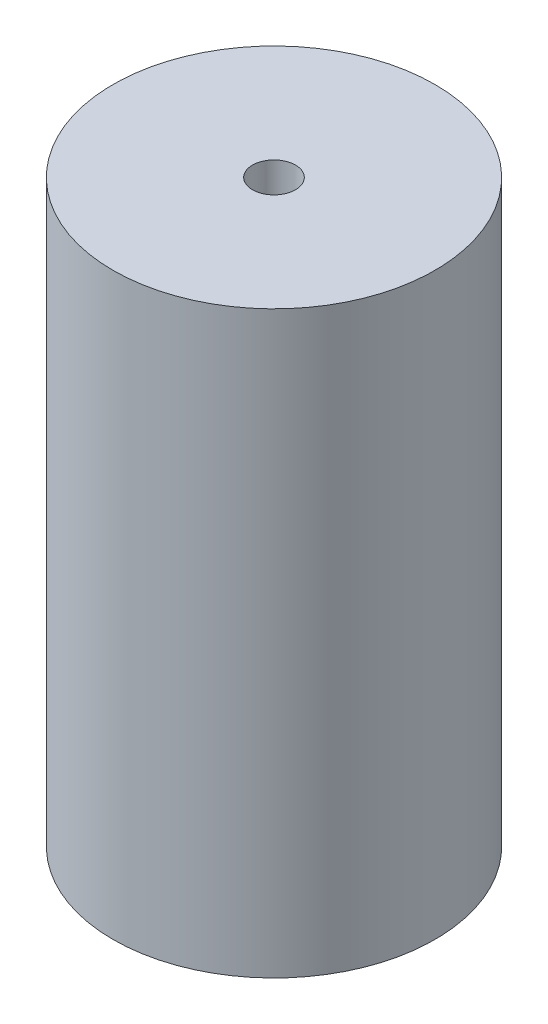
ISO-10303-21;
HEADER;
FILE_DESCRIPTION(('STEP AP214'),'2;1');
FILE_NAME('part.step','',(''),(''),'','','');
FILE_SCHEMA(('AUTOMOTIVE_DESIGN { 1 0 10303 214 1 1 1 1 }'));
ENDSEC;
DATA;
#1=APPLICATION_CONTEXT('core data for automotive mechanical design processes');
#2=APPLICATION_PROTOCOL_DEFINITION('international standard','automotive_design',2000,#1);
#3=PRODUCT_CONTEXT('',#1,'mechanical');
#4=PRODUCT('Part','Part','',(#3));
#5=PRODUCT_RELATED_PRODUCT_CATEGORY('part','',(#4));
#6=PRODUCT_DEFINITION_FORMATION('','',#4);
#7=PRODUCT_DEFINITION_CONTEXT('part definition',#1,'design');
#8=PRODUCT_DEFINITION('design','',#6,#7);
#9=PRODUCT_DEFINITION_SHAPE('','',#8);
#10=(LENGTH_UNIT() NAMED_UNIT(*) SI_UNIT(.MILLI.,.METRE.));
#11=(NAMED_UNIT(*) PLANE_ANGLE_UNIT() SI_UNIT($,.RADIAN.));
#12=(NAMED_UNIT(*) SI_UNIT($,.STERADIAN.) SOLID_ANGLE_UNIT());
#13=UNCERTAINTY_MEASURE_WITH_UNIT(LENGTH_MEASURE(1.E-05),#10,'distance_accuracy_value','');
#14=(GEOMETRIC_REPRESENTATION_CONTEXT(3) GLOBAL_UNCERTAINTY_ASSIGNED_CONTEXT((#13)) GLOBAL_UNIT_ASSIGNED_CONTEXT((#10,
#11,#12)) REPRESENTATION_CONTEXT('',''));
#15=CARTESIAN_POINT('',(0.,0.,0.));
#16=DIRECTION('',(0.,0.,1.));
#17=DIRECTION('',(1.,0.,0.));
#18=AXIS2_PLACEMENT_3D('',#15,#16,#17);
#19=CARTESIAN_POINT('',(0.,27.,0.));
#20=DIRECTION('',(0.,-1.,0.));
#21=DIRECTION('',(0.,0.,-1.));
#22=AXIS2_PLACEMENT_3D('',#19,#20,#21);
#23=CYLINDRICAL_SURFACE('',#22,7.5);
#24=CARTESIAN_POINT('',(0.,23.6,-7.5));
#25=CARTESIAN_POINT('',(-0.0887944293338554,23.5999968941954,-7.4999983570598));
#26=CARTESIAN_POINT('',(-0.177626889700681,23.5925833655204,-7.49840703800838));
#27=CARTESIAN_POINT('',(-0.352772204992272,23.563153761428,-7.49221258982039));
#28=CARTESIAN_POINT('',(-0.439083150622766,23.5411269054233,-7.48760723719598));
#29=CARTESIAN_POINT('',(-0.60662858018066,23.4831890480461,-7.47589793294748));
#30=CARTESIAN_POINT('',(-0.687868139445263,23.4472921948786,-7.46879652810656));
#31=CARTESIAN_POINT('',(-0.843167757727074,23.3626773923973,-7.45286320133509));
#32=CARTESIAN_POINT('',(-0.917228073407921,23.3139599016631,-7.4440313413038));
#33=CARTESIAN_POINT('',(-1.05720419368928,23.2042971695346,-7.42545480782523));
#34=CARTESIAN_POINT('',(-1.12299434543086,23.1431933668969,-7.41569927510424));
#35=CARTESIAN_POINT('',(-1.24347351522622,23.010833063914,-7.39645215099328));
#36=CARTESIAN_POINT('',(-1.29816158128342,22.9395756937978,-7.38696058229821));
#37=CARTESIAN_POINT('',(-1.39543277767187,22.7880094049401,-7.36920930951561));
#38=CARTESIAN_POINT('',(-1.43788322502763,22.7076135566835,-7.36096353805546));
#39=CARTESIAN_POINT('',(-1.50862340101052,22.5406246831015,-7.34679287525929));
#40=CARTESIAN_POINT('',(-1.53691473453874,22.4540323614034,-7.34086772090353));
#41=CARTESIAN_POINT('',(-1.5781204953587,22.2784683808897,-7.33211955105285));
#42=CARTESIAN_POINT('',(-1.59125680705956,22.189551074592,-7.32925182047022));
#43=CARTESIAN_POINT('',(-1.60246934089929,22.0107319558493,-7.32680881403605));
#44=CARTESIAN_POINT('',(-1.60054732105774,21.9208302595528,-7.32723315384412));
#45=CARTESIAN_POINT('',(-1.58187655808685,21.7442360444831,-7.33128581769295));
#46=CARTESIAN_POINT('',(-1.56538455643806,21.6575149158877,-7.33485865843677));
#47=CARTESIAN_POINT('',(-1.51844828834832,21.4880993483017,-7.34471814062502));
#48=CARTESIAN_POINT('',(-1.48800327344863,21.4054051255831,-7.3510049276482));
#49=CARTESIAN_POINT('',(-1.41378668233803,21.2456636265598,-7.36563922179753));
#50=CARTESIAN_POINT('',(-1.36991548636568,21.1686640952086,-7.37400204199822));
#51=CARTESIAN_POINT('',(-1.27016199217251,21.0230242867712,-7.39183660364213));
#52=CARTESIAN_POINT('',(-1.21427813244002,20.9543850982549,-7.40130848917848));
#53=CARTESIAN_POINT('',(-1.09072196751541,20.8259352460815,-7.4205326849195));
#54=CARTESIAN_POINT('',(-1.02283110172082,20.7663348821362,-7.43028675890513));
#55=CARTESIAN_POINT('',(-0.877908758701801,20.6593325863125,-7.44879883076769));
#56=CARTESIAN_POINT('',(-0.800877131200496,20.6119308550241,-7.45755681226393));
#57=CARTESIAN_POINT('',(-0.639610081827261,20.5306233249926,-7.4731161994162));
#58=CARTESIAN_POINT('',(-0.555360898326547,20.496744037718,-7.47991375438739));
#59=CARTESIAN_POINT('',(-0.382188547319413,20.4436806587957,-7.49075760800742));
#60=CARTESIAN_POINT('',(-0.293266027489786,20.4244945365341,-7.49480428682212));
#61=CARTESIAN_POINT('',(-0.115076046551738,20.4016655698161,-7.49963667143352));
#62=CARTESIAN_POINT('',(-0.0258469966592114,20.397735300314,-7.50048267119555));
#63=CARTESIAN_POINT('',(0.151992686527999,20.4047520312125,-7.49898689492793));
#64=CARTESIAN_POINT('',(0.240603359252846,20.4156980741656,-7.49664532405204));
#65=CARTESIAN_POINT('',(0.413746062380253,20.4519182252163,-7.48907546339841));
#66=CARTESIAN_POINT('',(0.498310863335301,20.4770425485252,-7.48387736587364));
#67=CARTESIAN_POINT('',(0.662026395792984,20.5407405838802,-7.47117587533623));
#68=CARTESIAN_POINT('',(0.741176681186478,20.5793154025379,-7.46367229265062));
#69=CARTESIAN_POINT('',(0.893011950773006,20.6694250746182,-7.44704294085318));
#70=CARTESIAN_POINT('',(0.965593659738485,20.7211300265148,-7.43789638159133));
#71=CARTESIAN_POINT('',(1.10115356003048,20.8358071560302,-7.41903990869546));
#72=CARTESIAN_POINT('',(1.16413056725132,20.8987807208118,-7.40932992580373));
#73=CARTESIAN_POINT('',(1.27982177561402,21.0355234396277,-7.39023419815026));
#74=CARTESIAN_POINT('',(1.33233743532724,21.1094619934081,-7.38085708289827));
#75=CARTESIAN_POINT('',(1.42420609305473,21.2652787115117,-7.36368318738415));
#76=CARTESIAN_POINT('',(1.46355965021717,21.3471565383705,-7.35588633999514));
#77=CARTESIAN_POINT('',(1.52772807228231,21.5160945750566,-7.3428278116798));
#78=CARTESIAN_POINT('',(1.55262307368944,21.6031232157705,-7.33755218632522));
#79=CARTESIAN_POINT('',(1.58740514879098,21.7802547258797,-7.33010689029808));
#80=CARTESIAN_POINT('',(1.59729448874882,21.870357128951,-7.32793675061545));
#81=CARTESIAN_POINT('',(1.60169174862619,22.0490792572769,-7.32697666157729));
#82=CARTESIAN_POINT('',(1.59651412882043,22.1376910205562,-7.32811760571581));
#83=CARTESIAN_POINT('',(1.57162478005708,22.3127486025521,-7.33349539816058));
#84=CARTESIAN_POINT('',(1.55191320540032,22.3991944442534,-7.33773221359929));
#85=CARTESIAN_POINT('',(1.49866402761735,22.5672312446234,-7.34879149338567));
#86=CARTESIAN_POINT('',(1.46517005919756,22.6488366035343,-7.35560579203591));
#87=CARTESIAN_POINT('',(1.38534516691845,22.8053170836912,-7.37105584436333));
#88=CARTESIAN_POINT('',(1.33901298148492,22.8801915425531,-7.37969177702726));
#89=CARTESIAN_POINT('',(1.23377464987916,23.0226396774495,-7.39801997202294));
#90=CARTESIAN_POINT('',(1.17464349733652,23.0900449482534,-7.40772937703983));
#91=CARTESIAN_POINT('',(1.0459443480745,23.2140795321431,-7.42699305436863));
#92=CARTESIAN_POINT('',(0.976373947694453,23.2707063566373,-7.43654729038956));
#93=CARTESIAN_POINT('',(0.827748193968452,23.3722360394568,-7.4545622712928));
#94=CARTESIAN_POINT('',(0.748587403501145,23.4169873098911,-7.46300824065792));
#95=CARTESIAN_POINT('',(0.583706040029167,23.4924789985566,-7.47770774713458));
#96=CARTESIAN_POINT('',(0.497991165498193,23.5232314299291,-7.48396316300769));
#97=CARTESIAN_POINT('',(0.343464763103908,23.5642297629138,-7.49243099511991));
#98=CARTESIAN_POINT('',(0.27550283564966,23.5776185146513,-7.4952520823403));
#99=CARTESIAN_POINT('',(0.138368271279888,23.5955046639985,-7.49903718747764));
#100=CARTESIAN_POINT('',(0.0691956833185947,23.6000024202901,-7.5000012803097));
#101=CARTESIAN_POINT('',(0.,23.6,-7.5));
#102=B_SPLINE_CURVE_WITH_KNOTS('',3,(#24,#25,#26,#27,#28,#29,#30,#31,#32,#33,#34,#35,#36,#37,
#38,#39,#40,#41,#42,#43,#44,#45,#46,#47,#48,#49,#50,#51,#52,#53,#54,#55,#56,#57,#58,#59,#60,#61,
#62,#63,#64,#65,#66,#67,#68,#69,#70,#71,#72,#73,#74,#75,#76,#77,#78,#79,#80,#81,#82,#83,#84,#85,
#86,#87,#88,#89,#90,#91,#92,#93,#94,#95,#96,#97,#98,#99,#100,#101),.UNSPECIFIED.,.T.,.F.,(4,2,2,
2,2,2,2,2,2,2,2,2,2,2,2,2,2,2,2,2,2,2,2,2,2,2,2,2,2,2,2,2,2,2,2,2,2,2,4),(0.,0.266130047854763,
0.532456644597193,0.798512286868048,1.0645584139285,1.33425388789939,1.60397247832158,
1.87651399120587,2.14902460517277,2.41749263134366,2.68592931506411,2.94972810159234,
3.21354104030559,3.47936093436642,3.74521540295248,4.01653060252532,4.28785026321979,
4.55969927797482,4.83151071607125,5.09817555204362,5.36482322613615,5.62870529395038,
5.89260907723844,6.1601236003675,6.42767107713311,6.69989324302714,6.97210384299803,
7.24279095265698,7.51343717712194,7.77847555890145,8.04351112692155,8.30771397733334,
8.57194279940303,8.84126112654219,9.1106415602667,9.38331104903345,9.65574610257701,
9.86314417471903,10.0705338798061),.UNSPECIFIED.);
#103=CARTESIAN_POINT('',(0.,23.6,-7.5));
#104=VERTEX_POINT('',#103);
#105=EDGE_CURVE('E109',#104,#104,#102,.T.);
#106=ORIENTED_EDGE('',*,*,#105,.T.);
#107=EDGE_LOOP('',(#106));
#108=FACE_BOUND('',#107,.T.);
#109=CARTESIAN_POINT('',(0.,6.6,-7.5));
#110=CARTESIAN_POINT('',(-0.0887944293338555,6.59999689419536,-7.4999983570598));
#111=CARTESIAN_POINT('',(-0.177626889700681,6.59258336552044,-7.49840703800838));
#112=CARTESIAN_POINT('',(-0.352772204992272,6.56315376142797,-7.49221258982039));
#113=CARTESIAN_POINT('',(-0.439083150622766,6.54112690542328,-7.48760723719598));
#114=CARTESIAN_POINT('',(-0.606628580180659,6.48318904804614,-7.47589793294748));
#115=CARTESIAN_POINT('',(-0.687868139445261,6.44729219487858,-7.46879652810656));
#116=CARTESIAN_POINT('',(-0.843167757727071,6.36267739239734,-7.45286320133509));
#117=CARTESIAN_POINT('',(-0.917228073407919,6.31395990166309,-7.4440313413038));
#118=CARTESIAN_POINT('',(-1.05720419368928,6.20429716953458,-7.42545480782523));
#119=CARTESIAN_POINT('',(-1.12299434543086,6.14319336689695,-7.41569927510424));
#120=CARTESIAN_POINT('',(-1.24347351522622,6.010833063914,-7.39645215099328));
#121=CARTESIAN_POINT('',(-1.29816158128342,5.9395756937978,-7.38696058229821));
#122=CARTESIAN_POINT('',(-1.39543277767187,5.78800940494011,-7.36920930951561));
#123=CARTESIAN_POINT('',(-1.43788322502763,5.70761355668354,-7.36096353805546));
#124=CARTESIAN_POINT('',(-1.50862340101052,5.54062468310145,-7.34679287525929));
#125=CARTESIAN_POINT('',(-1.53691473453874,5.45403236140341,-7.34086772090353));
#126=CARTESIAN_POINT('',(-1.5781204953587,5.27846838088968,-7.33211955105285));
#127=CARTESIAN_POINT('',(-1.59125680705956,5.18955107459205,-7.32925182047022));
#128=CARTESIAN_POINT('',(-1.60246934089929,5.01073195584931,-7.32680881403605));
#129=CARTESIAN_POINT('',(-1.60054732105774,4.92083025955284,-7.32723315384412));
#130=CARTESIAN_POINT('',(-1.58187655808685,4.74423604448313,-7.33128581769295));
#131=CARTESIAN_POINT('',(-1.56538455643806,4.6575149158877,-7.33485865843677));
#132=CARTESIAN_POINT('',(-1.51844828834832,4.48809934830167,-7.34471814062502));
#133=CARTESIAN_POINT('',(-1.48800327344863,4.4054051255831,-7.3510049276482));
#134=CARTESIAN_POINT('',(-1.41378668233803,4.24566362655982,-7.36563922179753));
#135=CARTESIAN_POINT('',(-1.36991548636568,4.1686640952086,-7.37400204199822));
#136=CARTESIAN_POINT('',(-1.27016199217251,4.02302428677124,-7.39183660364213));
#137=CARTESIAN_POINT('',(-1.21427813244002,3.95438509825491,-7.40130848917848));
#138=CARTESIAN_POINT('',(-1.09072196751541,3.82593524608154,-7.4205326849195));
#139=CARTESIAN_POINT('',(-1.02283110172082,3.76633488213618,-7.43028675890513));
#140=CARTESIAN_POINT('',(-0.877908758701801,3.65933258631255,-7.44879883076769));
#141=CARTESIAN_POINT('',(-0.800877131200497,3.61193085502408,-7.45755681226393));
#142=CARTESIAN_POINT('',(-0.639610081827262,3.53062332499256,-7.4731161994162));
#143=CARTESIAN_POINT('',(-0.555360898326548,3.49674403771802,-7.47991375438739));
#144=CARTESIAN_POINT('',(-0.382188547319413,3.44368065879573,-7.49075760800742));
#145=CARTESIAN_POINT('',(-0.293266027489785,3.42449453653411,-7.49480428682212));
#146=CARTESIAN_POINT('',(-0.115076046551737,3.40166556981615,-7.49963667143352));
#147=CARTESIAN_POINT('',(-0.0258469966592105,3.39773530031401,-7.50048267119555));
#148=CARTESIAN_POINT('',(0.151992686527999,3.40475203121251,-7.49898689492793));
#149=CARTESIAN_POINT('',(0.240603359252846,3.41569807416565,-7.49664532405204));
#150=CARTESIAN_POINT('',(0.413746062380252,3.45191822521633,-7.48907546339841));
#151=CARTESIAN_POINT('',(0.498310863335301,3.47704254852517,-7.48387736587364));
#152=CARTESIAN_POINT('',(0.662026395792983,3.54074058388016,-7.47117587533623));
#153=CARTESIAN_POINT('',(0.741176681186478,3.5793154025379,-7.46367229265062));
#154=CARTESIAN_POINT('',(0.893011950773004,3.66942507461825,-7.44704294085318));
#155=CARTESIAN_POINT('',(0.965593659738481,3.72113002651483,-7.43789638159133));
#156=CARTESIAN_POINT('',(1.10115356003048,3.83580715603025,-7.41903990869546));
#157=CARTESIAN_POINT('',(1.16413056725132,3.8987807208118,-7.40932992580373));
#158=CARTESIAN_POINT('',(1.27982177561402,4.03552343962769,-7.39023419815026));
#159=CARTESIAN_POINT('',(1.33233743532724,4.10946199340809,-7.38085708289827));
#160=CARTESIAN_POINT('',(1.42420609305472,4.26527871151165,-7.36368318738415));
#161=CARTESIAN_POINT('',(1.46355965021716,4.34715653837054,-7.35588633999514));
#162=CARTESIAN_POINT('',(1.52772807228231,4.5160945750566,-7.3428278116798));
#163=CARTESIAN_POINT('',(1.55262307368944,4.6031232157705,-7.33755218632522));
#164=CARTESIAN_POINT('',(1.58740514879098,4.78025472587967,-7.33010689029808));
#165=CARTESIAN_POINT('',(1.59729448874882,4.87035712895102,-7.32793675061545));
#166=CARTESIAN_POINT('',(1.60169174862619,5.04907925727693,-7.32697666157729));
#167=CARTESIAN_POINT('',(1.59651412882043,5.13769102055621,-7.32811760571581));
#168=CARTESIAN_POINT('',(1.57162478005708,5.31274860255213,-7.33349539816058));
#169=CARTESIAN_POINT('',(1.55191320540032,5.39919444425336,-7.33773221359929));
#170=CARTESIAN_POINT('',(1.49866402761734,5.5672312446234,-7.34879149338567));
#171=CARTESIAN_POINT('',(1.46517005919756,5.64883660353434,-7.35560579203591));
#172=CARTESIAN_POINT('',(1.38534516691845,5.80531708369125,-7.37105584436333));
#173=CARTESIAN_POINT('',(1.33901298148492,5.8801915425531,-7.37969177702726));
#174=CARTESIAN_POINT('',(1.23377464987916,6.02263967744949,-7.39801997202294));
#175=CARTESIAN_POINT('',(1.17464349733653,6.09004494825338,-7.40772937703983));
#176=CARTESIAN_POINT('',(1.0459443480745,6.21407953214307,-7.42699305436863));
#177=CARTESIAN_POINT('',(0.976373947694455,6.27070635663727,-7.43654729038956));
#178=CARTESIAN_POINT('',(0.827748193968452,6.37223603945681,-7.4545622712928));
#179=CARTESIAN_POINT('',(0.748587403501145,6.41698730989109,-7.46300824065792));
#180=CARTESIAN_POINT('',(0.583706040029168,6.49247899855657,-7.47770774713458));
#181=CARTESIAN_POINT('',(0.497991165498194,6.52323142992907,-7.48396316300769));
#182=CARTESIAN_POINT('',(0.34346476310391,6.56422976291382,-7.49243099511991));
#183=CARTESIAN_POINT('',(0.275502835649662,6.57761851465133,-7.4952520823403));
#184=CARTESIAN_POINT('',(0.138368271279889,6.59550466399851,-7.49903718747764));
#185=CARTESIAN_POINT('',(0.0691956833185954,6.60000242029006,-7.5000012803097));
#186=CARTESIAN_POINT('',(0.,6.6,-7.5));
#187=B_SPLINE_CURVE_WITH_KNOTS('',3,(#109,#110,#111,#112,#113,#114,#115,#116,#117,#118,#119,
#120,#121,#122,#123,#124,#125,#126,#127,#128,#129,#130,#131,#132,#133,#134,#135,#136,#137,#138,
#139,#140,#141,#142,#143,#144,#145,#146,#147,#148,#149,#150,#151,#152,#153,#154,#155,#156,#157,
#158,#159,#160,#161,#162,#163,#164,#165,#166,#167,#168,#169,#170,#171,#172,#173,#174,#175,#176,
#177,#178,#179,#180,#181,#182,#183,#184,#185,#186),.UNSPECIFIED.,.T.,.F.,(4,2,2,2,2,2,2,2,2,2,2,
2,2,2,2,2,2,2,2,2,2,2,2,2,2,2,2,2,2,2,2,2,2,2,2,2,2,2,4),(0.,0.266130047854763,
0.532456644597193,0.798512286868045,1.0645584139285,1.33425388789939,1.60397247832158,
1.87651399120587,2.14902460517277,2.41749263134366,2.68592931506411,2.94972810159234,
3.21354104030559,3.47936093436643,3.74521540295248,4.01653060252532,4.28785026321978,
4.55969927797482,4.83151071607125,5.09817555204362,5.36482322613614,5.62870529395038,
5.89260907723843,6.16012360036749,6.42767107713311,6.69989324302713,6.97210384299803,
7.24279095265699,7.51343717712194,7.77847555890145,8.04351112692155,8.30771397733335,
8.57194279940303,8.84126112654219,9.1106415602667,9.38331104903345,9.65574610257701,
9.86314417471903,10.0705338798061),.UNSPECIFIED.);
#188=CARTESIAN_POINT('',(0.,6.6,-7.5));
#189=VERTEX_POINT('',#188);
#190=EDGE_CURVE('E116',#189,#189,#187,.T.);
#191=ORIENTED_EDGE('',*,*,#190,.T.);
#192=EDGE_LOOP('',(#191));
#193=FACE_BOUND('',#192,.T.);
#194=CARTESIAN_POINT('',(0.,27.,0.));
#195=DIRECTION('',(0.,1.,0.));
#196=DIRECTION('',(0.,0.,1.));
#197=AXIS2_PLACEMENT_3D('',#194,#195,#196);
#198=CIRCLE('',#197,7.5);
#199=CARTESIAN_POINT('',(0.,27.,7.5));
#200=VERTEX_POINT('',#199);
#201=EDGE_CURVE('E83',#200,#200,#198,.T.);
#202=ORIENTED_EDGE('',*,*,#201,.F.);
#203=EDGE_LOOP('',(#202));
#204=FACE_BOUND('',#203,.T.);
#205=CARTESIAN_POINT('',(0.,0.,0.));
#206=DIRECTION('',(0.,1.,0.));
#207=DIRECTION('',(0.,0.,1.));
#208=AXIS2_PLACEMENT_3D('',#205,#206,#207);
#209=CIRCLE('',#208,7.5);
#210=CARTESIAN_POINT('',(0.,0.,7.5));
#211=VERTEX_POINT('',#210);
#212=EDGE_CURVE('E159',#211,#211,#209,.T.);
#213=ORIENTED_EDGE('',*,*,#212,.T.);
#214=EDGE_LOOP('',(#213));
#215=FACE_BOUND('',#214,.T.);
#216=ADVANCED_FACE('F37',(#108,#193,#204,#215),#23,.T.);
#217=CARTESIAN_POINT('',(0.,27.,0.));
#218=DIRECTION('',(0.,1.,0.));
#219=DIRECTION('',(0.,0.,1.));
#220=AXIS2_PLACEMENT_3D('',#217,#218,#219);
#221=PLANE('',#220);
#222=CARTESIAN_POINT('',(0.,27.,0.));
#223=DIRECTION('',(0.,1.,0.));
#224=DIRECTION('',(0.,0.,1.));
#225=AXIS2_PLACEMENT_3D('',#222,#223,#224);
#226=CIRCLE('',#225,1.);
#227=CARTESIAN_POINT('',(0.,27.,1.));
#228=VERTEX_POINT('',#227);
#229=EDGE_CURVE('E168',#228,#228,#226,.T.);
#230=ORIENTED_EDGE('',*,*,#229,.F.);
#231=EDGE_LOOP('',(#230));
#232=FACE_BOUND('',#231,.T.);
#233=ORIENTED_EDGE('',*,*,#201,.T.);
#234=EDGE_LOOP('',(#233));
#235=FACE_BOUND('',#234,.T.);
#236=ADVANCED_FACE('F124',(#232,#235),#221,.T.);
#237=CARTESIAN_POINT('',(0.,0.,0.));
#238=DIRECTION('',(0.,1.,0.));
#239=DIRECTION('',(0.,0.,1.));
#240=AXIS2_PLACEMENT_3D('',#237,#238,#239);
#241=PLANE('',#240);
#242=CARTESIAN_POINT('',(0.,0.,0.));
#243=DIRECTION('',(0.,1.,0.));
#244=DIRECTION('',(0.,0.,1.));
#245=AXIS2_PLACEMENT_3D('',#242,#243,#244);
#246=CIRCLE('',#245,5.99999999999999);
#247=CARTESIAN_POINT('',(0.,0.,5.99999999999999));
#248=VERTEX_POINT('',#247);
#249=EDGE_CURVE('E11',#248,#248,#246,.T.);
#250=ORIENTED_EDGE('',*,*,#249,.T.);
#251=EDGE_LOOP('',(#250));
#252=FACE_BOUND('',#251,.T.);
#253=ORIENTED_EDGE('',*,*,#212,.F.);
#254=EDGE_LOOP('',(#253));
#255=FACE_BOUND('',#254,.T.);
#256=ADVANCED_FACE('F126',(#252,#255),#241,.F.);
#257=CARTESIAN_POINT('',(0.,11.,0.));
#258=DIRECTION('',(0.,-1.,0.));
#259=DIRECTION('',(0.,0.,-1.));
#260=AXIS2_PLACEMENT_3D('',#257,#258,#259);
#261=CYLINDRICAL_SURFACE('',#260,5.);
#262=CARTESIAN_POINT('',(0.,1.73205080756886,0.));
#263=DIRECTION('',(0.,1.,0.));
#264=DIRECTION('',(0.,0.,1.));
#265=AXIS2_PLACEMENT_3D('',#262,#263,#264);
#266=CIRCLE('',#265,5.);
#267=CARTESIAN_POINT('',(0.,1.73205080756886,5.));
#268=VERTEX_POINT('',#267);
#269=EDGE_CURVE('E46',#268,#268,#266,.F.);
#270=ORIENTED_EDGE('',*,*,#269,.T.);
#271=EDGE_LOOP('',(#270));
#272=FACE_BOUND('',#271,.T.);
#273=CARTESIAN_POINT('',(0.,6.6,-5.));
#274=CARTESIAN_POINT('',(0.0874958063159797,6.59999975634942,-4.99999978543627));
#275=CARTESIAN_POINT('',(0.174994637059061,6.59279940472074,-4.99768184156355));
#276=CARTESIAN_POINT('',(0.347426901237483,6.56426818047074,-4.98866262172227));
#277=CARTESIAN_POINT('',(0.432359863373708,6.54293472818209,-4.98196054553558));
#278=CARTESIAN_POINT('',(0.597149225791565,6.48693507878823,-4.9649038363541));
#279=CARTESIAN_POINT('',(0.677013473384595,6.4522901076294,-4.95455502045191));
#280=CARTESIAN_POINT('',(0.829798762851157,6.37074316991274,-4.93126901642872));
#281=CARTESIAN_POINT('',(0.902718607024946,6.32383909423439,-4.91833138300386));
#282=CARTESIAN_POINT('',(1.04189475779498,6.21751588649597,-4.89077067933825));
#283=CARTESIAN_POINT('',(1.1078960922464,6.15777290104658,-4.87610957732918));
#284=CARTESIAN_POINT('',(1.22913423693228,6.02815693345259,-4.8469706570307));
#285=CARTESIAN_POINT('',(1.28436891793797,5.95828195234513,-4.83249287552328));
#286=CARTESIAN_POINT('',(1.38391395073831,5.80814714548962,-4.8049481079903));
#287=CARTESIAN_POINT('',(1.42790123109944,5.72766371872946,-4.79192785635417));
#288=CARTESIAN_POINT('',(1.5016091713459,5.55995765622989,-4.76934657798646));
#289=CARTESIAN_POINT('',(1.53133379773326,5.47273690201169,-4.75978458968016));
#290=CARTESIAN_POINT('',(1.57473134311321,5.29691739272712,-4.74560122760597));
#291=CARTESIAN_POINT('',(1.58887896846385,5.20844789824797,-4.74083414932744));
#292=CARTESIAN_POINT('',(1.60220433058851,5.03027240081554,-4.73634831045));
#293=CARTESIAN_POINT('',(1.6013862709372,4.94056675214803,-4.73662813227306));
#294=CARTESIAN_POINT('',(1.58517380736381,4.76643441511176,-4.74207619100075));
#295=CARTESIAN_POINT('',(1.57038842132725,4.6819435465553,-4.7470401743042));
#296=CARTESIAN_POINT('',(1.52765058974139,4.51671115557794,-4.76096457446162));
#297=CARTESIAN_POINT('',(1.49969668269327,4.4359700504148,-4.76992543490025));
#298=CARTESIAN_POINT('',(1.43099645158812,4.27910214117426,-4.7909865416364));
#299=CARTESIAN_POINT('',(1.39006273103722,4.20306378004852,-4.80313229469362));
#300=CARTESIAN_POINT('',(1.29669494334068,4.05873795697323,-4.82917444861168));
#301=CARTESIAN_POINT('',(1.24425776827155,3.99045259725646,-4.8430713221454));
#302=CARTESIAN_POINT('',(1.12640551540387,3.86013532713372,-4.87186372141871));
#303=CARTESIAN_POINT('',(1.06048936249402,3.79855922306119,-4.8867752080818));
#304=CARTESIAN_POINT('',(0.91908143221715,3.68722132176635,-4.91533168114877));
#305=CARTESIAN_POINT('',(0.843588875652695,3.63746048685711,-4.92897656433707));
#306=CARTESIAN_POINT('',(0.684261580712375,3.55083655671978,-4.95361789744584));
#307=CARTESIAN_POINT('',(0.600361279440636,3.51408689916357,-4.96459080547942));
#308=CARTESIAN_POINT('',(0.427135850361131,3.45536040333729,-4.98248161100196));
#309=CARTESIAN_POINT('',(0.337812463131548,3.43337885218328,-4.98940080204637));
#310=CARTESIAN_POINT('',(0.160141789589318,3.40559993333478,-4.99819424239135));
#311=CARTESIAN_POINT('',(0.0719002860170734,3.3991859263889,-5.00026060178154));
#312=CARTESIAN_POINT('',(-0.104410269588106,3.4009792182213,-4.99968655318444));
#313=CARTESIAN_POINT('',(-0.19247934608744,3.40918426530988,-4.99704687004206));
#314=CARTESIAN_POINT('',(-0.363535018203812,3.43949011308117,-4.98748380317497));
#315=CARTESIAN_POINT('',(-0.446594362478023,3.4612199100859,-4.98067486649266));
#316=CARTESIAN_POINT('',(-0.607861654600583,3.51750179939625,-4.96357585995349));
#317=CARTESIAN_POINT('',(-0.686068993794125,3.55205549660218,-4.95328535439547));
#318=CARTESIAN_POINT('',(-0.837596923870445,3.63397101717815,-4.92995531019905));
#319=CARTESIAN_POINT('',(-0.910745620500967,3.6816325119423,-4.9168532627009));
#320=CARTESIAN_POINT('',(-1.04821150300662,3.78805387298564,-4.8893940824048));
#321=CARTESIAN_POINT('',(-1.11252617555398,3.8468168864583,-4.87503659432078));
#322=CARTESIAN_POINT('',(-1.23328321488635,3.97667415961096,-4.84592967283237));
#323=CARTESIAN_POINT('',(-1.2892857947562,4.04818026768848,-4.83118884166735));
#324=CARTESIAN_POINT('',(-1.38854141992569,4.19989467445821,-4.80360443110145));
#325=CARTESIAN_POINT('',(-1.43179457025642,4.28010290145405,-4.79076083607138));
#326=CARTESIAN_POINT('',(-1.50407580301231,4.44684357865608,-4.76856262886575));
#327=CARTESIAN_POINT('',(-1.53315066307446,4.53335413498969,-4.75919656820051));
#328=CARTESIAN_POINT('',(-1.57620668246201,4.71040720981033,-4.74511281699328));
#329=CARTESIAN_POINT('',(-1.59019395006567,4.80094808113599,-4.74039324536734));
#330=CARTESIAN_POINT('',(-1.60222535311566,4.97887596916399,-4.73633927898768));
#331=CARTESIAN_POINT('',(-1.60099388446006,5.06620901132899,-4.73676019091382));
#332=CARTESIAN_POINT('',(-1.5843835514937,5.2393570054347,-4.74234159093745));
#333=CARTESIAN_POINT('',(-1.56900540861121,5.32517203456103,-4.74750183734632));
#334=CARTESIAN_POINT('',(-1.52503332416461,5.49148342537688,-4.76180543144416));
#335=CARTESIAN_POINT('',(-1.49665627942706,5.57204319889287,-4.77088327236763));
#336=CARTESIAN_POINT('',(-1.42766427484382,5.72732176040081,-4.79197975594362));
#337=CARTESIAN_POINT('',(-1.38704674114626,5.8020393157627,-4.8039990169992));
#338=CARTESIAN_POINT('',(-1.29279266707432,5.94680962981441,-4.83023494368376));
#339=CARTESIAN_POINT('',(-1.23869308431578,6.01654826273404,-4.8445211905268));
#340=CARTESIAN_POINT('',(-1.11981399792884,6.14619174582096,-4.87337180847353));
#341=CARTESIAN_POINT('',(-1.05503158166823,6.20609390519865,-4.88793625446696));
#342=CARTESIAN_POINT('',(-0.913912210298352,6.31645828592383,-4.91631108200117));
#343=CARTESIAN_POINT('',(-0.83725135176078,6.3665189518843,-4.93007751880386));
#344=CARTESIAN_POINT('',(-0.676163529926937,6.45298018809723,-4.95473787697861));
#345=CARTESIAN_POINT('',(-0.591739263208157,6.48938547932079,-4.96563279071293));
#346=CARTESIAN_POINT('',(-0.423663431644845,6.54524777983044,-4.98268341064065));
#347=CARTESIAN_POINT('',(-0.34037676648733,6.56571845058311,-4.98911901301451));
#348=CARTESIAN_POINT('',(-0.171394001076119,6.59309314290401,-4.99777693541394));
#349=CARTESIAN_POINT('',(-0.0856984512613946,6.60000023864547,-5.00000021015613));
#350=CARTESIAN_POINT('',(0.,6.6,-5.));
#351=B_SPLINE_CURVE_WITH_KNOTS('',3,(#273,#274,#275,#276,#277,#278,#279,#280,#281,#282,#283,
#284,#285,#286,#287,#288,#289,#290,#291,#292,#293,#294,#295,#296,#297,#298,#299,#300,#301,#302,
#303,#304,#305,#306,#307,#308,#309,#310,#311,#312,#313,#314,#315,#316,#317,#318,#319,#320,#321,
#322,#323,#324,#325,#326,#327,#328,#329,#330,#331,#332,#333,#334,#335,#336,#337,#338,#339,#340,
#341,#342,#343,#344,#345,#346,#347,#348,#349,#350),.UNSPECIFIED.,.T.,.F.,(4,2,2,2,2,2,2,2,2,2,2,
2,2,2,2,2,2,2,2,2,2,2,2,2,2,2,2,2,2,2,2,2,2,2,2,2,2,2,4),(0.,0.262172289866487,
0.524392446348364,0.786196202111712,1.04804502964703,1.31749718151567,1.58700256668426,
1.86354828826627,2.14001705671955,2.40780489999506,2.67551752794223,2.93207089351445,
3.18865273918778,3.44912195934763,3.70966163813009,3.98267284808623,4.25570628624555,
4.53106471334194,4.80633522466348,5.07051010591344,5.33464430132699,5.59183416387789,
5.84905622438333,6.11273355055081,6.37648573964818,6.65122993053059,6.92597185797942,
7.19980110675104,7.47351945288796,7.73426134972847,7.99498995042988,8.25151822881316,
8.50810048600705,8.77513756675922,9.04224757485583,9.31866285531259,9.5949824844973,
9.85182740305347,10.1086141011961),.UNSPECIFIED.);
#352=CARTESIAN_POINT('',(0.,6.6,-5.));
#353=VERTEX_POINT('',#352);
#354=EDGE_CURVE('E115',#353,#353,#351,.T.);
#355=ORIENTED_EDGE('',*,*,#354,.T.);
#356=EDGE_LOOP('',(#355));
#357=FACE_BOUND('',#356,.T.);
#358=CARTESIAN_POINT('',(0.,11.,0.));
#359=DIRECTION('',(0.,-1.,0.));
#360=DIRECTION('',(0.,0.,-1.));
#361=AXIS2_PLACEMENT_3D('',#358,#359,#360);
#362=CIRCLE('',#361,5.);
#363=CARTESIAN_POINT('',(0.,11.,-5.));
#364=VERTEX_POINT('',#363);
#365=EDGE_CURVE('E161',#364,#364,#362,.T.);
#366=ORIENTED_EDGE('',*,*,#365,.F.);
#367=EDGE_LOOP('',(#366));
#368=FACE_BOUND('',#367,.T.);
#369=ADVANCED_FACE('F130',(#272,#357,#368),#261,.F.);
#370=CARTESIAN_POINT('',(0.,11.,0.));
#371=DIRECTION('',(0.,-1.,0.));
#372=DIRECTION('',(0.,0.,-1.));
#373=AXIS2_PLACEMENT_3D('',#370,#371,#372);
#374=PLANE('',#373);
#375=ORIENTED_EDGE('',*,*,#365,.T.);
#376=EDGE_LOOP('',(#375));
#377=FACE_BOUND('',#376,.T.);
#378=ADVANCED_FACE('F137',(#377),#374,.T.);
#379=CARTESIAN_POINT('',(0.,16.,0.));
#380=DIRECTION('',(0.,1.,0.));
#381=DIRECTION('',(0.,0.,1.));
#382=AXIS2_PLACEMENT_3D('',#379,#380,#381);
#383=CYLINDRICAL_SURFACE('',#382,1.);
#384=CARTESIAN_POINT('',(-1.,23.2489995996797,0.));
#385=CARTESIAN_POINT('',(-1.00000328539393,23.2489910640436,-0.0250420540148207));
#386=CARTESIAN_POINT('',(-0.999058765160675,23.2497535982507,-0.0500674742118358));
#387=CARTESIAN_POINT('',(-0.995313430001535,23.2527410650808,-0.0998643443058831));
#388=CARTESIAN_POINT('',(-0.992514649737564,23.2549643947646,-0.124636042389315));
#389=CARTESIAN_POINT('',(-0.981462984757022,23.2636535221198,-0.197856406974047));
#390=CARTESIAN_POINT('',(-0.970553061140591,23.2721415331924,-0.245692464431897));
#391=CARTESIAN_POINT('',(-0.942322179199957,23.2931865877711,-0.338181049488111));
#392=CARTESIAN_POINT('',(-0.925026740877777,23.3057274094906,-0.382845416977049));
#393=CARTESIAN_POINT('',(-0.88463251703944,23.3334265027444,-0.468702223860541));
#394=CARTESIAN_POINT('',(-0.861519376407032,23.3485912193438,-0.509885733466363));
#395=CARTESIAN_POINT('',(-0.806584380835408,23.3822411687592,-0.593504064488005));
#396=CARTESIAN_POINT('',(-0.774013024077662,23.4008997561385,-0.635376469656298));
#397=CARTESIAN_POINT('',(-0.702628067205133,23.4380315725651,-0.713523485157994));
#398=CARTESIAN_POINT('',(-0.663812097198333,23.4565047284003,-0.749795959980557));
#399=CARTESIAN_POINT('',(-0.575350940229269,23.4938349440437,-0.82008168551111));
#400=CARTESIAN_POINT('',(-0.524963903435486,23.5124685033494,-0.85329188942785));
#401=CARTESIAN_POINT('',(-0.41792711847892,23.5454648740026,-0.91049850052491));
#402=CARTESIAN_POINT('',(-0.361283211390195,23.5598316231502,-0.93450340918476));
#403=CARTESIAN_POINT('',(-0.249421549868178,23.5813587216514,-0.969985839852788));
#404=CARTESIAN_POINT('',(-0.19464461040703,23.5891033651859,-0.982489111650539));
#405=CARTESIAN_POINT('',(-0.0832841865488821,23.5988043511029,-0.998105648047833));
#406=CARTESIAN_POINT('',(-0.026702661077674,23.6007667676554,-1.00122876646888));
#407=CARTESIAN_POINT('',(0.0784526392740357,23.5988232733515,-0.998115449260167));
#408=CARTESIAN_POINT('',(0.12708197158917,23.5956696015437,-0.993078902381487));
#409=CARTESIAN_POINT('',(0.222645270403292,23.585162185302,-0.976106425666681));
#410=CARTESIAN_POINT('',(0.269579106821178,23.5778081193318,-0.964169967647948));
#411=CARTESIAN_POINT('',(0.36071249983897,23.5595048266963,-0.933916573923894));
#412=CARTESIAN_POINT('',(0.404904639521327,23.5485463136522,-0.91558314978533));
#413=CARTESIAN_POINT('',(0.489617523238295,23.52388433681,-0.873223743403864));
#414=CARTESIAN_POINT('',(0.530137622792231,23.5101803925105,-0.849196764548419));
#415=CARTESIAN_POINT('',(0.611763300932602,23.47914865845,-0.792782576196341));
#416=CARTESIAN_POINT('',(0.652315779155349,23.4615821614752,-0.759727463924009));
#417=CARTESIAN_POINT('',(0.7276667281705,23.4255701194436,-0.687907951812534));
#418=CARTESIAN_POINT('',(0.762454629731507,23.4071230378713,-0.649133305972074));
#419=CARTESIAN_POINT('',(0.829918992316841,23.3685513724911,-0.560987909472559));
#420=CARTESIAN_POINT('',(0.861716155108108,23.3485252120002,-0.510894268975426));
#421=CARTESIAN_POINT('',(0.91625402736567,23.3120803599259,-0.404978062509962));
#422=CARTESIAN_POINT('',(0.939028874954073,23.2956481775061,-0.349178116508105));
#423=CARTESIAN_POINT('',(0.970760554490714,23.2719814563633,-0.244844948968151));
#424=CARTESIAN_POINT('',(0.981593410723949,23.2635517193302,-0.197168590217668));
#425=CARTESIAN_POINT('',(0.992567083192402,23.2549228060251,-0.124198000609632));
#426=CARTESIAN_POINT('',(0.995346127653486,23.2527150344935,-0.0995141269436815));
#427=CARTESIAN_POINT('',(0.999065514005864,23.2497481911495,-0.0498920569120488));
#428=CARTESIAN_POINT('',(1.00000358802861,23.2489909062009,-0.0249535848576153));
#429=CARTESIAN_POINT('',(1.,23.2489995996797,0.));
#430=B_SPLINE_CURVE_WITH_KNOTS('',3,(#384,#385,#386,#387,#388,#389,#390,#391,#392,#393,#394,
#395,#396,#397,#398,#399,#400,#401,#402,#403,#404,#405,#406,#407,#408,#409,#410,#411,#412,#413,
#414,#415,#416,#417,#418,#419,#420,#421,#422,#423,#424,#425,#426,#427,#428,#429),.UNSPECIFIED.,
.F.,.F.,(4,2,2,2,2,2,2,2,2,2,2,2,2,2,2,2,2,2,2,2,2,2,4),(0.,0.0750660602833219,0.15004988741288,
0.298594049041059,0.446550862395293,0.594876399159773,0.762934514536497,0.931056560730076,
1.11950027461957,1.30776953120684,1.47689193500085,1.64583661399502,1.79210727474604,
1.93838913388068,2.08505086007946,2.23173827726279,2.39665615749106,2.56187314342196,
2.74881737652598,2.93504734548029,3.08308170409928,3.15779368467744,3.23259764438416),.UNSPECIFIED.);
#431=CARTESIAN_POINT('',(-1.,23.2489995996797,0.));
#432=VERTEX_POINT('',#431);
#433=CARTESIAN_POINT('',(1.,23.2489995996797,0.));
#434=VERTEX_POINT('',#433);
#435=EDGE_CURVE('E75',#432,#434,#430,.T.);
#436=ORIENTED_EDGE('',*,*,#435,.T.);
#437=DIRECTION('',(0.,1.,0.));
#438=VECTOR('',#437,1.);
#439=CARTESIAN_POINT('',(1.,16.,0.));
#440=LINE('',#439,#438);
#441=CARTESIAN_POINT('',(1.,20.7510004003203,0.));
#442=VERTEX_POINT('',#441);
#443=EDGE_CURVE('E67',#434,#442,#440,.F.);
#444=ORIENTED_EDGE('',*,*,#443,.T.);
#445=CARTESIAN_POINT('',(1.,20.7510004003203,0.));
#446=CARTESIAN_POINT('',(1.00000328539393,20.7510089359564,-0.0250420540148207));
#447=CARTESIAN_POINT('',(0.999058765160675,20.7502464017493,-0.0500674742118358));
#448=CARTESIAN_POINT('',(0.995313430001535,20.7472589349192,-0.0998643443058831));
#449=CARTESIAN_POINT('',(0.992514649737564,20.7450356052354,-0.124636042389315));
#450=CARTESIAN_POINT('',(0.981462984757022,20.7363464778802,-0.197856406974047));
#451=CARTESIAN_POINT('',(0.970553061140591,20.7278584668076,-0.245692464431897));
#452=CARTESIAN_POINT('',(0.942322179199957,20.7068134122289,-0.338181049488111));
#453=CARTESIAN_POINT('',(0.925026740877777,20.6942725905093,-0.382845416977049));
#454=CARTESIAN_POINT('',(0.88463251703944,20.6665734972556,-0.468702223860541));
#455=CARTESIAN_POINT('',(0.861519376407032,20.6514087806562,-0.509885733466363));
#456=CARTESIAN_POINT('',(0.806584380835408,20.6177588312408,-0.593504064488004));
#457=CARTESIAN_POINT('',(0.774013024077662,20.5991002438615,-0.635376469656297));
#458=CARTESIAN_POINT('',(0.702628067205133,20.5619684274349,-0.713523485157994));
#459=CARTESIAN_POINT('',(0.663812097198333,20.5434952715997,-0.749795959980556));
#460=CARTESIAN_POINT('',(0.57535094022927,20.5061650559563,-0.82008168551111));
#461=CARTESIAN_POINT('',(0.524963903435487,20.4875314966506,-0.853291889427849));
#462=CARTESIAN_POINT('',(0.417927118478921,20.4545351259974,-0.91049850052491));
#463=CARTESIAN_POINT('',(0.361283211390196,20.4401683768498,-0.93450340918476));
#464=CARTESIAN_POINT('',(0.249421549868178,20.4186412783486,-0.969985839852788));
#465=CARTESIAN_POINT('',(0.19464461040703,20.4108966348141,-0.982489111650539));
#466=CARTESIAN_POINT('',(0.0832841865488821,20.4011956488971,-0.998105648047833));
#467=CARTESIAN_POINT('',(0.026702661077674,20.3992332323446,-1.00122876646888));
#468=CARTESIAN_POINT('',(-0.0784526392740357,20.4011767266485,-0.998115449260167));
#469=CARTESIAN_POINT('',(-0.12708197158917,20.4043303984563,-0.993078902381487));
#470=CARTESIAN_POINT('',(-0.222645270403292,20.414837814698,-0.976106425666681));
#471=CARTESIAN_POINT('',(-0.269579106821178,20.4221918806682,-0.964169967647948));
#472=CARTESIAN_POINT('',(-0.36071249983897,20.4404951733037,-0.933916573923894));
#473=CARTESIAN_POINT('',(-0.404904639521327,20.4514536863478,-0.91558314978533));
#474=CARTESIAN_POINT('',(-0.489617523238295,20.47611566319,-0.873223743403864));
#475=CARTESIAN_POINT('',(-0.530137622792231,20.4898196074895,-0.849196764548419));
#476=CARTESIAN_POINT('',(-0.611763300932602,20.52085134155,-0.792782576196341));
#477=CARTESIAN_POINT('',(-0.652315779155349,20.5384178385248,-0.759727463924009));
#478=CARTESIAN_POINT('',(-0.7276667281705,20.5744298805564,-0.687907951812534));
#479=CARTESIAN_POINT('',(-0.762454629731507,20.5928769621287,-0.649133305972074));
#480=CARTESIAN_POINT('',(-0.82991899231684,20.6314486275089,-0.560987909472559));
#481=CARTESIAN_POINT('',(-0.861716155108108,20.6514747879998,-0.510894268975427));
#482=CARTESIAN_POINT('',(-0.91625402736567,20.6879196400741,-0.404978062509962));
#483=CARTESIAN_POINT('',(-0.939028874954073,20.7043518224939,-0.349178116508105));
#484=CARTESIAN_POINT('',(-0.970760554490713,20.7280185436367,-0.244844948968151));
#485=CARTESIAN_POINT('',(-0.981593410723949,20.7364482806698,-0.197168590217669));
#486=CARTESIAN_POINT('',(-0.992567083192402,20.7450771939749,-0.124198000609633));
#487=CARTESIAN_POINT('',(-0.995346127653485,20.7472849655065,-0.0995141269436826));
#488=CARTESIAN_POINT('',(-0.999065514005864,20.7502518088505,-0.0498920569120494));
#489=CARTESIAN_POINT('',(-1.00000358802861,20.7510090937991,-0.0249535848576155));
#490=CARTESIAN_POINT('',(-1.,20.7510004003203,0.));
#491=B_SPLINE_CURVE_WITH_KNOTS('',3,(#445,#446,#447,#448,#449,#450,#451,#452,#453,#454,#455,
#456,#457,#458,#459,#460,#461,#462,#463,#464,#465,#466,#467,#468,#469,#470,#471,#472,#473,#474,
#475,#476,#477,#478,#479,#480,#481,#482,#483,#484,#485,#486,#487,#488,#489,#490),.UNSPECIFIED.,
.F.,.F.,(4,2,2,2,2,2,2,2,2,2,2,2,2,2,2,2,2,2,2,2,2,2,4),(0.,0.0750660602833219,0.15004988741288,
0.298594049041059,0.446550862395293,0.594876399159773,0.762934514536496,0.931056560730076,
1.11950027461957,1.30776953120684,1.47689193500085,1.64583661399502,1.79210727474604,
1.93838913388068,2.08505086007946,2.23173827726279,2.39665615749106,2.56187314342196,
2.74881737652597,2.93504734548029,3.08308170409928,3.15779368467744,3.23259764438416),.UNSPECIFIED.);
#492=CARTESIAN_POINT('',(-1.,20.7510004003203,0.));
#493=VERTEX_POINT('',#492);
#494=EDGE_CURVE('E59',#442,#493,#491,.T.);
#495=ORIENTED_EDGE('',*,*,#494,.T.);
#496=DIRECTION('',(0.,1.,0.));
#497=VECTOR('',#496,1.);
#498=CARTESIAN_POINT('',(-1.,16.,0.));
#499=LINE('',#498,#497);
#500=EDGE_CURVE('E80',#493,#432,#499,.T.);
#501=ORIENTED_EDGE('',*,*,#500,.T.);
#502=EDGE_LOOP('',(#436,#444,#495,#501));
#503=FACE_BOUND('',#502,.T.);
#504=CARTESIAN_POINT('',(0.,16.,0.));
#505=DIRECTION('',(0.,1.,0.));
#506=DIRECTION('',(0.,0.,1.));
#507=AXIS2_PLACEMENT_3D('',#504,#505,#506);
#508=CIRCLE('',#507,1.);
#509=CARTESIAN_POINT('',(0.,16.,1.));
#510=VERTEX_POINT('',#509);
#511=EDGE_CURVE('E165',#510,#510,#508,.T.);
#512=ORIENTED_EDGE('',*,*,#511,.F.);
#513=EDGE_LOOP('',(#512));
#514=FACE_BOUND('',#513,.T.);
#515=ORIENTED_EDGE('',*,*,#229,.T.);
#516=EDGE_LOOP('',(#515));
#517=FACE_BOUND('',#516,.T.);
#518=ADVANCED_FACE('F78',(#503,#514,#517),#383,.F.);
#519=CARTESIAN_POINT('',(0.,16.,0.));
#520=DIRECTION('',(0.,1.,0.));
#521=DIRECTION('',(0.,0.,1.));
#522=AXIS2_PLACEMENT_3D('',#519,#520,#521);
#523=PLANE('',#522);
#524=ORIENTED_EDGE('',*,*,#511,.T.);
#525=EDGE_LOOP('',(#524));
#526=FACE_BOUND('',#525,.T.);
#527=ADVANCED_FACE('F103',(#526),#523,.T.);
#528=CARTESIAN_POINT('',(0.,22.,-11.));
#529=DIRECTION('',(0.,0.,1.));
#530=DIRECTION('',(1.,0.,0.));
#531=AXIS2_PLACEMENT_3D('',#528,#529,#530);
#532=CYLINDRICAL_SURFACE('',#531,1.6);
#533=CARTESIAN_POINT('',(0.,22.,0.));
#534=DIRECTION('',(0.,0.,1.));
#535=DIRECTION('',(1.,0.,0.));
#536=AXIS2_PLACEMENT_3D('',#533,#534,#535);
#537=CIRCLE('',#536,1.6);
#538=EDGE_CURVE('E69',#442,#434,#537,.T.);
#539=ORIENTED_EDGE('',*,*,#538,.T.);
#540=ORIENTED_EDGE('',*,*,#435,.F.);
#541=EDGE_CURVE('E52',#432,#493,#537,.T.);
#542=ORIENTED_EDGE('',*,*,#541,.T.);
#543=ORIENTED_EDGE('',*,*,#494,.F.);
#544=EDGE_LOOP('',(#539,#540,#542,#543));
#545=FACE_BOUND('',#544,.T.);
#546=ORIENTED_EDGE('',*,*,#105,.F.);
#547=EDGE_LOOP('',(#546));
#548=FACE_BOUND('',#547,.T.);
#549=ADVANCED_FACE('F73',(#545,#548),#532,.F.);
#550=CARTESIAN_POINT('',(0.,22.,0.));
#551=DIRECTION('',(0.,0.,1.));
#552=DIRECTION('',(1.,0.,0.));
#553=AXIS2_PLACEMENT_3D('',#550,#551,#552);
#554=PLANE('',#553);
#555=ORIENTED_EDGE('',*,*,#538,.F.);
#556=ORIENTED_EDGE('',*,*,#443,.F.);
#557=EDGE_LOOP('',(#555,#556));
#558=FACE_BOUND('',#557,.T.);
#559=ADVANCED_FACE('F68',(#558),#554,.F.);
#560=ORIENTED_EDGE('',*,*,#541,.F.);
#561=ORIENTED_EDGE('',*,*,#500,.F.);
#562=EDGE_LOOP('',(#560,#561));
#563=FACE_BOUND('',#562,.T.);
#564=ADVANCED_FACE('F153',(#563),#554,.F.);
#565=CARTESIAN_POINT('',(0.,5.,-11.));
#566=DIRECTION('',(0.,0.,1.));
#567=DIRECTION('',(1.,0.,0.));
#568=AXIS2_PLACEMENT_3D('',#565,#566,#567);
#569=CYLINDRICAL_SURFACE('',#568,1.6);
#570=ORIENTED_EDGE('',*,*,#354,.F.);
#571=EDGE_LOOP('',(#570));
#572=FACE_BOUND('',#571,.T.);
#573=ORIENTED_EDGE('',*,*,#190,.F.);
#574=EDGE_LOOP('',(#573));
#575=FACE_BOUND('',#574,.T.);
#576=ADVANCED_FACE('F104',(#572,#575),#569,.F.);
#577=CARTESIAN_POINT('',(0.,1.73205080756886,0.));
#578=DIRECTION('',(0.,-1.,0.));
#579=DIRECTION('',(0.,0.,-1.));
#580=AXIS2_PLACEMENT_3D('',#577,#578,#579);
#581=CONICAL_SURFACE('',#580,5.,0.5235987755983);
#582=ORIENTED_EDGE('',*,*,#249,.F.);
#583=EDGE_LOOP('',(#582));
#584=FACE_BOUND('',#583,.T.);
#585=ORIENTED_EDGE('',*,*,#269,.F.);
#586=EDGE_LOOP('',(#585));
#587=FACE_BOUND('',#586,.T.);
#588=ADVANCED_FACE('F40',(#584,#587),#581,.F.);
#589=CLOSED_SHELL('',(#216,#236,#256,#369,#378,#518,#527,#549,#559,#564,#576,#588));
#590=MANIFOLD_SOLID_BREP('B2',#589);
#591=ADVANCED_BREP_SHAPE_REPRESENTATION('',(#18,#590),#14);
#592=SHAPE_DEFINITION_REPRESENTATION(#9,#591);
ENDSEC;
END-ISO-10303-21;
